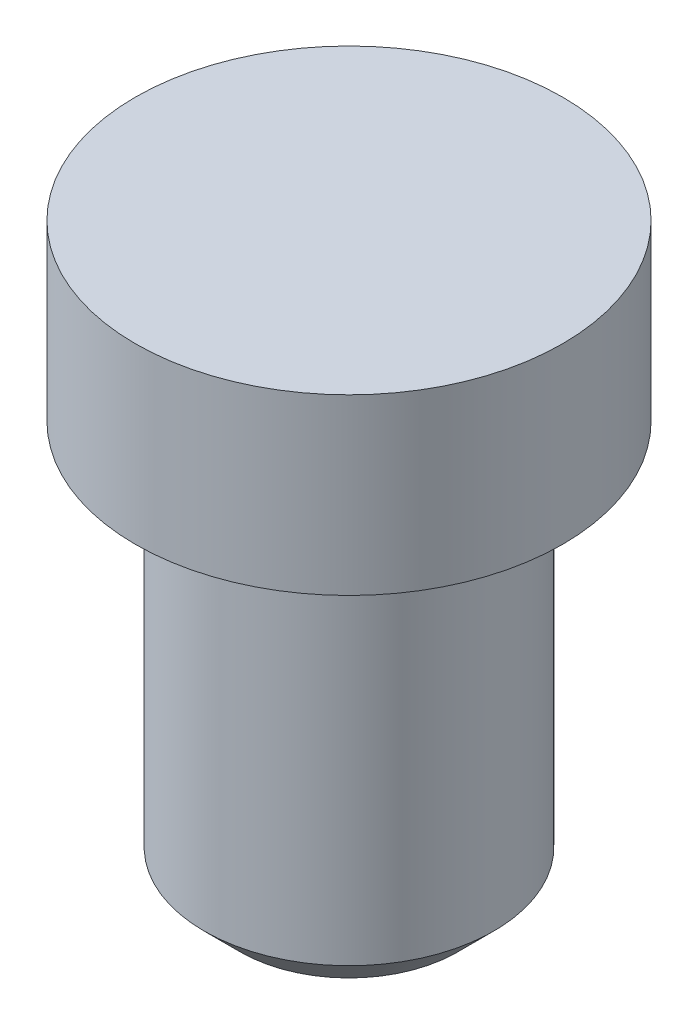
ISO-10303-21;
HEADER;
FILE_DESCRIPTION(('STEP AP214'),'2;1');
FILE_NAME('part.step','',(''),(''),'','','');
FILE_SCHEMA(('AUTOMOTIVE_DESIGN { 1 0 10303 214 1 1 1 1 }'));
ENDSEC;
DATA;
#1=APPLICATION_CONTEXT('core data for automotive mechanical design processes');
#2=APPLICATION_PROTOCOL_DEFINITION('international standard','automotive_design',2000,#1);
#3=PRODUCT_CONTEXT('',#1,'mechanical');
#4=PRODUCT('Part','Part','',(#3));
#5=PRODUCT_RELATED_PRODUCT_CATEGORY('part','',(#4));
#6=PRODUCT_DEFINITION_FORMATION('','',#4);
#7=PRODUCT_DEFINITION_CONTEXT('part definition',#1,'design');
#8=PRODUCT_DEFINITION('design','',#6,#7);
#9=PRODUCT_DEFINITION_SHAPE('','',#8);
#10=(LENGTH_UNIT() NAMED_UNIT(*) SI_UNIT(.MILLI.,.METRE.));
#11=(NAMED_UNIT(*) PLANE_ANGLE_UNIT() SI_UNIT($,.RADIAN.));
#12=(NAMED_UNIT(*) SI_UNIT($,.STERADIAN.) SOLID_ANGLE_UNIT());
#13=UNCERTAINTY_MEASURE_WITH_UNIT(LENGTH_MEASURE(1.E-05),#10,'distance_accuracy_value','');
#14=(GEOMETRIC_REPRESENTATION_CONTEXT(3) GLOBAL_UNCERTAINTY_ASSIGNED_CONTEXT((#13)) GLOBAL_UNIT_ASSIGNED_CONTEXT((#10,
#11,#12)) REPRESENTATION_CONTEXT('',''));
#15=CARTESIAN_POINT('',(0.,0.,0.));
#16=DIRECTION('',(0.,0.,1.));
#17=DIRECTION('',(1.,0.,0.));
#18=AXIS2_PLACEMENT_3D('',#15,#16,#17);
#19=CARTESIAN_POINT('',(0.,0.,0.));
#20=DIRECTION('',(0.,-1.,0.));
#21=DIRECTION('',(0.,0.,-1.));
#22=AXIS2_PLACEMENT_3D('',#19,#20,#21);
#23=PLANE('',#22);
#24=CARTESIAN_POINT('',(0.,0.,0.));
#25=DIRECTION('',(0.,1.,0.));
#26=DIRECTION('',(0.,0.,1.));
#27=AXIS2_PLACEMENT_3D('',#24,#25,#26);
#28=CIRCLE('',#27,2.95);
#29=CARTESIAN_POINT('',(0.,0.,2.95));
#30=VERTEX_POINT('',#29);
#31=EDGE_CURVE('E44',#30,#30,#28,.T.);
#32=ORIENTED_EDGE('',*,*,#31,.T.);
#33=EDGE_LOOP('',(#32));
#34=FACE_BOUND('',#33,.T.);
#35=ADVANCED_FACE('F33',(#34),#23,.F.);
#36=CARTESIAN_POINT('',(0.,0.,0.));
#37=DIRECTION('',(0.,1.,0.));
#38=DIRECTION('',(0.,0.,1.));
#39=AXIS2_PLACEMENT_3D('',#36,#37,#38);
#40=CYLINDRICAL_SURFACE('',#39,2.95);
#41=ORIENTED_EDGE('',*,*,#31,.F.);
#42=EDGE_LOOP('',(#41));
#43=FACE_BOUND('',#42,.T.);
#44=CARTESIAN_POINT('',(0.,-2.4,0.));
#45=DIRECTION('',(0.,1.,0.));
#46=DIRECTION('',(0.,0.,1.));
#47=AXIS2_PLACEMENT_3D('',#44,#45,#46);
#48=CIRCLE('',#47,2.95);
#49=CARTESIAN_POINT('',(0.,-2.4,2.95));
#50=VERTEX_POINT('',#49);
#51=EDGE_CURVE('E48',#50,#50,#48,.T.);
#52=ORIENTED_EDGE('',*,*,#51,.T.);
#53=EDGE_LOOP('',(#52));
#54=FACE_BOUND('',#53,.T.);
#55=ADVANCED_FACE('F68',(#43,#54),#40,.T.);
#56=CARTESIAN_POINT('',(2.95,-2.4,0.));
#57=DIRECTION('',(0.,1.,0.));
#58=DIRECTION('',(0.,0.,1.));
#59=AXIS2_PLACEMENT_3D('',#56,#57,#58);
#60=PLANE('',#59);
#61=ORIENTED_EDGE('',*,*,#51,.F.);
#62=EDGE_LOOP('',(#61));
#63=FACE_BOUND('',#62,.T.);
#64=CARTESIAN_POINT('',(0.,-2.4,0.));
#65=DIRECTION('',(0.,1.,0.));
#66=DIRECTION('',(0.,0.,1.));
#67=AXIS2_PLACEMENT_3D('',#64,#65,#66);
#68=CIRCLE('',#67,2.);
#69=CARTESIAN_POINT('',(0.,-2.4,2.));
#70=VERTEX_POINT('',#69);
#71=EDGE_CURVE('E53',#70,#70,#68,.T.);
#72=ORIENTED_EDGE('',*,*,#71,.T.);
#73=EDGE_LOOP('',(#72));
#74=FACE_BOUND('',#73,.T.);
#75=ADVANCED_FACE('F57',(#63,#74),#60,.F.);
#76=CARTESIAN_POINT('',(0.,0.,0.));
#77=DIRECTION('',(0.,1.,0.));
#78=DIRECTION('',(0.,0.,1.));
#79=AXIS2_PLACEMENT_3D('',#76,#77,#78);
#80=CYLINDRICAL_SURFACE('',#79,2.);
#81=CARTESIAN_POINT('',(0.,-7.5,0.));
#82=DIRECTION('',(0.,1.,0.));
#83=DIRECTION('',(0.,0.,1.));
#84=AXIS2_PLACEMENT_3D('',#81,#82,#83);
#85=CIRCLE('',#84,2.);
#86=CARTESIAN_POINT('',(0.,-7.5,2.));
#87=VERTEX_POINT('',#86);
#88=EDGE_CURVE('E40',#87,#87,#85,.T.);
#89=ORIENTED_EDGE('',*,*,#88,.T.);
#90=EDGE_LOOP('',(#89));
#91=FACE_BOUND('',#90,.T.);
#92=ORIENTED_EDGE('',*,*,#71,.F.);
#93=EDGE_LOOP('',(#92));
#94=FACE_BOUND('',#93,.T.);
#95=ADVANCED_FACE('F59',(#91,#94),#80,.T.);
#96=CARTESIAN_POINT('',(2.,-8.,0.));
#97=DIRECTION('',(0.,1.,0.));
#98=DIRECTION('',(0.,0.,1.));
#99=AXIS2_PLACEMENT_3D('',#96,#97,#98);
#100=PLANE('',#99);
#101=CARTESIAN_POINT('',(0.,-8.,0.));
#102=DIRECTION('',(0.,1.,0.));
#103=DIRECTION('',(0.,0.,1.));
#104=AXIS2_PLACEMENT_3D('',#101,#102,#103);
#105=CIRCLE('',#104,1.5);
#106=CARTESIAN_POINT('',(0.,-8.,1.5));
#107=VERTEX_POINT('',#106);
#108=EDGE_CURVE('E10',#107,#107,#105,.F.);
#109=ORIENTED_EDGE('',*,*,#108,.T.);
#110=EDGE_LOOP('',(#109));
#111=FACE_BOUND('',#110,.T.);
#112=ADVANCED_FACE('F61',(#111),#100,.F.);
#113=CARTESIAN_POINT('',(0.,-7.5,0.));
#114=DIRECTION('',(0.,1.,0.));
#115=DIRECTION('',(0.,0.,1.));
#116=AXIS2_PLACEMENT_3D('',#113,#114,#115);
#117=CONICAL_SURFACE('',#116,2.,0.785398163397451);
#118=ORIENTED_EDGE('',*,*,#108,.F.);
#119=EDGE_LOOP('',(#118));
#120=FACE_BOUND('',#119,.T.);
#121=ORIENTED_EDGE('',*,*,#88,.F.);
#122=EDGE_LOOP('',(#121));
#123=FACE_BOUND('',#122,.T.);
#124=ADVANCED_FACE('F35',(#120,#123),#117,.T.);
#125=CLOSED_SHELL('',(#35,#55,#75,#95,#112,#124));
#126=MANIFOLD_SOLID_BREP('B2',#125);
#127=ADVANCED_BREP_SHAPE_REPRESENTATION('',(#18,#126),#14);
#128=SHAPE_DEFINITION_REPRESENTATION(#9,#127);
ENDSEC;
END-ISO-10303-21;
